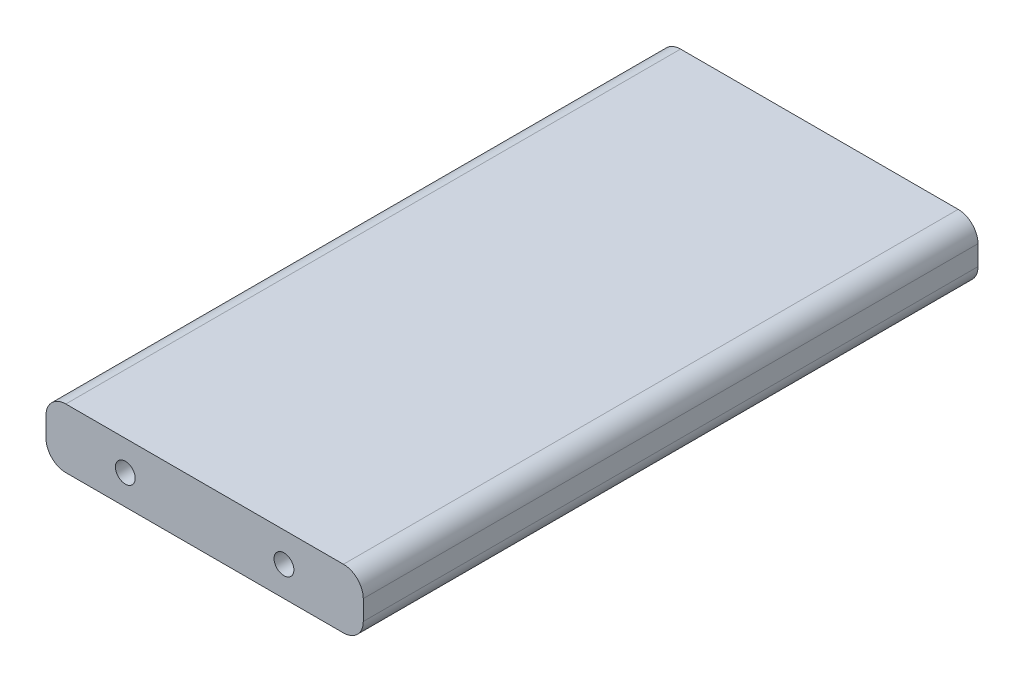
ISO-10303-21;
HEADER;
FILE_DESCRIPTION(('STEP AP214'),'2;1');
FILE_NAME('part.step','',(''),(''),'','','');
FILE_SCHEMA(('AUTOMOTIVE_DESIGN { 1 0 10303 214 1 1 1 1 }'));
ENDSEC;
DATA;
#1=APPLICATION_CONTEXT('core data for automotive mechanical design processes');
#2=APPLICATION_PROTOCOL_DEFINITION('international standard','automotive_design',2000,#1);
#3=PRODUCT_CONTEXT('',#1,'mechanical');
#4=PRODUCT('Part','Part','',(#3));
#5=PRODUCT_RELATED_PRODUCT_CATEGORY('part','',(#4));
#6=PRODUCT_DEFINITION_FORMATION('','',#4);
#7=PRODUCT_DEFINITION_CONTEXT('part definition',#1,'design');
#8=PRODUCT_DEFINITION('design','',#6,#7);
#9=PRODUCT_DEFINITION_SHAPE('','',#8);
#10=(LENGTH_UNIT() NAMED_UNIT(*) SI_UNIT(.MILLI.,.METRE.));
#11=(NAMED_UNIT(*) PLANE_ANGLE_UNIT() SI_UNIT($,.RADIAN.));
#12=(NAMED_UNIT(*) SI_UNIT($,.STERADIAN.) SOLID_ANGLE_UNIT());
#13=UNCERTAINTY_MEASURE_WITH_UNIT(LENGTH_MEASURE(1.E-05),#10,'distance_accuracy_value','');
#14=(GEOMETRIC_REPRESENTATION_CONTEXT(3) GLOBAL_UNCERTAINTY_ASSIGNED_CONTEXT((#13)) GLOBAL_UNIT_ASSIGNED_CONTEXT((#10,
#11,#12)) REPRESENTATION_CONTEXT('',''));
#15=CARTESIAN_POINT('',(0.,0.,0.));
#16=DIRECTION('',(0.,0.,1.));
#17=DIRECTION('',(1.,0.,0.));
#18=AXIS2_PLACEMENT_3D('',#15,#16,#17);
#19=CARTESIAN_POINT('',(-44.45,9.525,98.425));
#20=DIRECTION('',(0.,-1.,0.));
#21=DIRECTION('',(0.,0.,-1.));
#22=AXIS2_PLACEMENT_3D('',#19,#20,#21);
#23=PLANE('',#22);
#24=DIRECTION('',(-1.,0.,0.));
#25=VECTOR('',#24,1.);
#26=CARTESIAN_POINT('',(44.45,9.525,98.425));
#27=LINE('',#26,#25);
#28=CARTESIAN_POINT('',(44.45,9.525,98.425));
#29=VERTEX_POINT('',#28);
#30=CARTESIAN_POINT('',(-44.45,9.525,98.425));
#31=VERTEX_POINT('',#30);
#32=EDGE_CURVE('E98',#29,#31,#27,.T.);
#33=ORIENTED_EDGE('',*,*,#32,.F.);
#34=DIRECTION('',(0.,0.,-1.));
#35=VECTOR('',#34,1.);
#36=CARTESIAN_POINT('',(44.45,9.525,98.425));
#37=LINE('',#36,#35);
#38=CARTESIAN_POINT('',(44.45,9.525,-98.425));
#39=VERTEX_POINT('',#38);
#40=EDGE_CURVE('E11',#29,#39,#37,.T.);
#41=ORIENTED_EDGE('',*,*,#40,.T.);
#42=DIRECTION('',(-1.,0.,0.));
#43=VECTOR('',#42,1.);
#44=CARTESIAN_POINT('',(-44.45,9.525,-98.425));
#45=LINE('',#44,#43);
#46=CARTESIAN_POINT('',(-44.45,9.525,-98.425));
#47=VERTEX_POINT('',#46);
#48=EDGE_CURVE('E111',#39,#47,#45,.T.);
#49=ORIENTED_EDGE('',*,*,#48,.T.);
#50=DIRECTION('',(0.,0.,-1.));
#51=VECTOR('',#50,1.);
#52=CARTESIAN_POINT('',(-44.45,9.525,98.425));
#53=LINE('',#52,#51);
#54=EDGE_CURVE('E109',#31,#47,#53,.T.);
#55=ORIENTED_EDGE('',*,*,#54,.F.);
#56=EDGE_LOOP('',(#33,#41,#49,#55));
#57=FACE_BOUND('',#56,.T.);
#58=ADVANCED_FACE('F33',(#57),#23,.F.);
#59=CARTESIAN_POINT('',(-44.45,3.175,98.425));
#60=DIRECTION('',(0.,0.,-1.));
#61=DIRECTION('',(-1.,0.,0.));
#62=AXIS2_PLACEMENT_3D('',#59,#60,#61);
#63=CYLINDRICAL_SURFACE('',#62,6.35);
#64=CARTESIAN_POINT('',(-44.45,3.175,-98.425));
#65=DIRECTION('',(0.,0.,1.));
#66=DIRECTION('',(1.,0.,0.));
#67=AXIS2_PLACEMENT_3D('',#64,#65,#66);
#68=CIRCLE('',#67,6.35);
#69=CARTESIAN_POINT('',(-50.8,3.17499999999996,-98.425));
#70=VERTEX_POINT('',#69);
#71=EDGE_CURVE('E131',#47,#70,#68,.T.);
#72=ORIENTED_EDGE('',*,*,#71,.T.);
#73=DIRECTION('',(0.,0.,-1.));
#74=VECTOR('',#73,1.);
#75=CARTESIAN_POINT('',(-50.8,3.17499999999996,98.425));
#76=LINE('',#75,#74);
#77=CARTESIAN_POINT('',(-50.8,3.17499999999996,98.425));
#78=VERTEX_POINT('',#77);
#79=EDGE_CURVE('E115',#78,#70,#76,.T.);
#80=ORIENTED_EDGE('',*,*,#79,.F.);
#81=CARTESIAN_POINT('',(-44.45,3.175,98.425));
#82=DIRECTION('',(0.,0.,1.));
#83=DIRECTION('',(1.,0.,0.));
#84=AXIS2_PLACEMENT_3D('',#81,#82,#83);
#85=CIRCLE('',#84,6.35);
#86=EDGE_CURVE('E102',#31,#78,#85,.T.);
#87=ORIENTED_EDGE('',*,*,#86,.F.);
#88=ORIENTED_EDGE('',*,*,#54,.T.);
#89=EDGE_LOOP('',(#72,#80,#87,#88));
#90=FACE_BOUND('',#89,.T.);
#91=ADVANCED_FACE('F117',(#90),#63,.T.);
#92=CARTESIAN_POINT('',(-50.8,-3.17499999999996,98.425));
#93=DIRECTION('',(1.,0.,0.));
#94=DIRECTION('',(0.,0.,-1.));
#95=AXIS2_PLACEMENT_3D('',#92,#93,#94);
#96=PLANE('',#95);
#97=DIRECTION('',(0.,-1.,0.));
#98=VECTOR('',#97,1.);
#99=CARTESIAN_POINT('',(-50.8,-3.17499999999996,-98.425));
#100=LINE('',#99,#98);
#101=CARTESIAN_POINT('',(-50.8,-3.17499999999996,-98.425));
#102=VERTEX_POINT('',#101);
#103=EDGE_CURVE('E134',#70,#102,#100,.T.);
#104=ORIENTED_EDGE('',*,*,#103,.T.);
#105=DIRECTION('',(0.,0.,-1.));
#106=VECTOR('',#105,1.);
#107=CARTESIAN_POINT('',(-50.8,-3.17499999999996,98.425));
#108=LINE('',#107,#106);
#109=CARTESIAN_POINT('',(-50.8,-3.17499999999996,98.425));
#110=VERTEX_POINT('',#109);
#111=EDGE_CURVE('E146',#110,#102,#108,.T.);
#112=ORIENTED_EDGE('',*,*,#111,.F.);
#113=DIRECTION('',(0.,-1.,0.));
#114=VECTOR('',#113,1.);
#115=CARTESIAN_POINT('',(-50.8,-3.17499999999996,98.425));
#116=LINE('',#115,#114);
#117=EDGE_CURVE('E120',#78,#110,#116,.T.);
#118=ORIENTED_EDGE('',*,*,#117,.F.);
#119=ORIENTED_EDGE('',*,*,#79,.T.);
#120=EDGE_LOOP('',(#104,#112,#118,#119));
#121=FACE_BOUND('',#120,.T.);
#122=ADVANCED_FACE('F179',(#121),#96,.F.);
#123=CARTESIAN_POINT('',(-44.45,-3.175,98.425));
#124=DIRECTION('',(0.,0.,-1.));
#125=DIRECTION('',(-1.,0.,0.));
#126=AXIS2_PLACEMENT_3D('',#123,#124,#125);
#127=CYLINDRICAL_SURFACE('',#126,6.35);
#128=CARTESIAN_POINT('',(-44.45,-3.175,-98.425));
#129=DIRECTION('',(0.,0.,1.));
#130=DIRECTION('',(1.,0.,0.));
#131=AXIS2_PLACEMENT_3D('',#128,#129,#130);
#132=CIRCLE('',#131,6.35);
#133=CARTESIAN_POINT('',(-44.45,-9.525,-98.425));
#134=VERTEX_POINT('',#133);
#135=EDGE_CURVE('E136',#102,#134,#132,.T.);
#136=ORIENTED_EDGE('',*,*,#135,.T.);
#137=DIRECTION('',(0.,0.,-1.));
#138=VECTOR('',#137,1.);
#139=CARTESIAN_POINT('',(-44.45,-9.525,98.425));
#140=LINE('',#139,#138);
#141=CARTESIAN_POINT('',(-44.45,-9.525,98.425));
#142=VERTEX_POINT('',#141);
#143=EDGE_CURVE('E129',#142,#134,#140,.T.);
#144=ORIENTED_EDGE('',*,*,#143,.F.);
#145=CARTESIAN_POINT('',(-44.45,-3.175,98.425));
#146=DIRECTION('',(0.,0.,1.));
#147=DIRECTION('',(1.,0.,0.));
#148=AXIS2_PLACEMENT_3D('',#145,#146,#147);
#149=CIRCLE('',#148,6.35);
#150=EDGE_CURVE('E122',#110,#142,#149,.T.);
#151=ORIENTED_EDGE('',*,*,#150,.F.);
#152=ORIENTED_EDGE('',*,*,#111,.T.);
#153=EDGE_LOOP('',(#136,#144,#151,#152));
#154=FACE_BOUND('',#153,.T.);
#155=ADVANCED_FACE('F175',(#154),#127,.T.);
#156=CARTESIAN_POINT('',(44.45,-9.525,98.425));
#157=DIRECTION('',(0.,1.,0.));
#158=DIRECTION('',(0.,0.,1.));
#159=AXIS2_PLACEMENT_3D('',#156,#157,#158);
#160=PLANE('',#159);
#161=DIRECTION('',(1.,0.,0.));
#162=VECTOR('',#161,1.);
#163=CARTESIAN_POINT('',(44.45,-9.525,-98.425));
#164=LINE('',#163,#162);
#165=CARTESIAN_POINT('',(44.45,-9.525,-98.425));
#166=VERTEX_POINT('',#165);
#167=EDGE_CURVE('E139',#134,#166,#164,.T.);
#168=ORIENTED_EDGE('',*,*,#167,.T.);
#169=DIRECTION('',(0.,0.,-1.));
#170=VECTOR('',#169,1.);
#171=CARTESIAN_POINT('',(44.45,-9.525,98.425));
#172=LINE('',#171,#170);
#173=CARTESIAN_POINT('',(44.45,-9.525,98.425));
#174=VERTEX_POINT('',#173);
#175=EDGE_CURVE('E56',#166,#174,#172,.F.);
#176=ORIENTED_EDGE('',*,*,#175,.T.);
#177=DIRECTION('',(1.,0.,0.));
#178=VECTOR('',#177,1.);
#179=CARTESIAN_POINT('',(-44.45,-9.525,98.425));
#180=LINE('',#179,#178);
#181=EDGE_CURVE('E127',#142,#174,#180,.T.);
#182=ORIENTED_EDGE('',*,*,#181,.F.);
#183=ORIENTED_EDGE('',*,*,#143,.T.);
#184=EDGE_LOOP('',(#168,#176,#182,#183));
#185=FACE_BOUND('',#184,.T.);
#186=ADVANCED_FACE('F171',(#185),#160,.F.);
#187=CARTESIAN_POINT('',(50.8,-3.17499999999996,98.425));
#188=DIRECTION('',(-1.,0.,0.));
#189=DIRECTION('',(0.,0.,1.));
#190=AXIS2_PLACEMENT_3D('',#187,#188,#189);
#191=PLANE('',#190);
#192=DIRECTION('',(0.,1.,0.));
#193=VECTOR('',#192,1.);
#194=CARTESIAN_POINT('',(50.8,9.525,98.425));
#195=LINE('',#194,#193);
#196=CARTESIAN_POINT('',(50.8,-3.175,98.425));
#197=VERTEX_POINT('',#196);
#198=CARTESIAN_POINT('',(50.8,3.175,98.425));
#199=VERTEX_POINT('',#198);
#200=EDGE_CURVE('E106',#197,#199,#195,.T.);
#201=ORIENTED_EDGE('',*,*,#200,.F.);
#202=DIRECTION('',(0.,0.,-1.));
#203=VECTOR('',#202,1.);
#204=CARTESIAN_POINT('',(50.8,-3.175,98.425));
#205=LINE('',#204,#203);
#206=CARTESIAN_POINT('',(50.8,-3.175,-98.425));
#207=VERTEX_POINT('',#206);
#208=EDGE_CURVE('E151',#197,#207,#205,.T.);
#209=ORIENTED_EDGE('',*,*,#208,.T.);
#210=DIRECTION('',(0.,1.,0.));
#211=VECTOR('',#210,1.);
#212=CARTESIAN_POINT('',(50.8,-3.17499999999996,-98.425));
#213=LINE('',#212,#211);
#214=CARTESIAN_POINT('',(50.8,3.175,-98.425));
#215=VERTEX_POINT('',#214);
#216=EDGE_CURVE('E141',#207,#215,#213,.T.);
#217=ORIENTED_EDGE('',*,*,#216,.T.);
#218=DIRECTION('',(0.,0.,-1.));
#219=VECTOR('',#218,1.);
#220=CARTESIAN_POINT('',(50.8,3.175,98.425));
#221=LINE('',#220,#219);
#222=EDGE_CURVE('E114',#215,#199,#221,.F.);
#223=ORIENTED_EDGE('',*,*,#222,.T.);
#224=EDGE_LOOP('',(#201,#209,#217,#223));
#225=FACE_BOUND('',#224,.T.);
#226=ADVANCED_FACE('F164',(#225),#191,.F.);
#227=CARTESIAN_POINT('',(-44.45,-3.175,98.425));
#228=DIRECTION('',(0.,0.,1.));
#229=DIRECTION('',(1.,0.,0.));
#230=AXIS2_PLACEMENT_3D('',#227,#228,#229);
#231=PLANE('',#230);
#232=CARTESIAN_POINT('',(-25.4,0.,98.425));
#233=DIRECTION('',(0.,0.,1.));
#234=DIRECTION('',(1.,0.,0.));
#235=AXIS2_PLACEMENT_3D('',#232,#233,#234);
#236=CIRCLE('',#235,3.175);
#237=CARTESIAN_POINT('',(-22.225,0.,98.425));
#238=VERTEX_POINT('',#237);
#239=EDGE_CURVE('E312',#238,#238,#236,.T.);
#240=ORIENTED_EDGE('',*,*,#239,.F.);
#241=EDGE_LOOP('',(#240));
#242=FACE_BOUND('',#241,.T.);
#243=CARTESIAN_POINT('',(25.4,0.,98.425));
#244=DIRECTION('',(0.,0.,1.));
#245=DIRECTION('',(1.,0.,0.));
#246=AXIS2_PLACEMENT_3D('',#243,#244,#245);
#247=CIRCLE('',#246,3.175);
#248=CARTESIAN_POINT('',(28.575,0.,98.425));
#249=VERTEX_POINT('',#248);
#250=EDGE_CURVE('E296',#249,#249,#247,.T.);
#251=ORIENTED_EDGE('',*,*,#250,.F.);
#252=EDGE_LOOP('',(#251));
#253=FACE_BOUND('',#252,.T.);
#254=ORIENTED_EDGE('',*,*,#181,.T.);
#255=CARTESIAN_POINT('',(44.45,-3.175,98.425));
#256=DIRECTION('',(0.,0.,1.));
#257=DIRECTION('',(1.,0.,0.));
#258=AXIS2_PLACEMENT_3D('',#255,#256,#257);
#259=CIRCLE('',#258,6.35);
#260=EDGE_CURVE('E41',#174,#197,#259,.T.);
#261=ORIENTED_EDGE('',*,*,#260,.T.);
#262=ORIENTED_EDGE('',*,*,#200,.T.);
#263=CARTESIAN_POINT('',(44.45,3.175,98.425));
#264=DIRECTION('',(0.,0.,1.));
#265=DIRECTION('',(1.,0.,0.));
#266=AXIS2_PLACEMENT_3D('',#263,#264,#265);
#267=CIRCLE('',#266,6.35);
#268=EDGE_CURVE('E48',#199,#29,#267,.T.);
#269=ORIENTED_EDGE('',*,*,#268,.T.);
#270=ORIENTED_EDGE('',*,*,#32,.T.);
#271=ORIENTED_EDGE('',*,*,#86,.T.);
#272=ORIENTED_EDGE('',*,*,#117,.T.);
#273=ORIENTED_EDGE('',*,*,#150,.T.);
#274=EDGE_LOOP('',(#254,#261,#262,#269,#270,#271,#272,#273));
#275=FACE_BOUND('',#274,.T.);
#276=ADVANCED_FACE('F100',(#242,#253,#275),#231,.T.);
#277=CARTESIAN_POINT('',(-44.45,-3.175,-98.425));
#278=DIRECTION('',(0.,0.,1.));
#279=DIRECTION('',(1.,0.,0.));
#280=AXIS2_PLACEMENT_3D('',#277,#278,#279);
#281=PLANE('',#280);
#282=CARTESIAN_POINT('',(-25.4,0.,-98.425));
#283=DIRECTION('',(0.,0.,1.));
#284=DIRECTION('',(1.,0.,0.));
#285=AXIS2_PLACEMENT_3D('',#282,#283,#284);
#286=CIRCLE('',#285,3.175);
#287=CARTESIAN_POINT('',(-22.225,0.,-98.425));
#288=VERTEX_POINT('',#287);
#289=EDGE_CURVE('E297',#288,#288,#286,.T.);
#290=ORIENTED_EDGE('',*,*,#289,.T.);
#291=EDGE_LOOP('',(#290));
#292=FACE_BOUND('',#291,.T.);
#293=CARTESIAN_POINT('',(25.4,0.,-98.425));
#294=DIRECTION('',(0.,0.,1.));
#295=DIRECTION('',(1.,0.,0.));
#296=AXIS2_PLACEMENT_3D('',#293,#294,#295);
#297=CIRCLE('',#296,3.175);
#298=CARTESIAN_POINT('',(28.575,0.,-98.425));
#299=VERTEX_POINT('',#298);
#300=EDGE_CURVE('E308',#299,#299,#297,.T.);
#301=ORIENTED_EDGE('',*,*,#300,.T.);
#302=EDGE_LOOP('',(#301));
#303=FACE_BOUND('',#302,.T.);
#304=ORIENTED_EDGE('',*,*,#216,.F.);
#305=CARTESIAN_POINT('',(44.45,-3.175,-98.425));
#306=DIRECTION('',(0.,0.,1.));
#307=DIRECTION('',(1.,0.,0.));
#308=AXIS2_PLACEMENT_3D('',#305,#306,#307);
#309=CIRCLE('',#308,6.35);
#310=EDGE_CURVE('E156',#207,#166,#309,.F.);
#311=ORIENTED_EDGE('',*,*,#310,.T.);
#312=ORIENTED_EDGE('',*,*,#167,.F.);
#313=ORIENTED_EDGE('',*,*,#135,.F.);
#314=ORIENTED_EDGE('',*,*,#103,.F.);
#315=ORIENTED_EDGE('',*,*,#71,.F.);
#316=ORIENTED_EDGE('',*,*,#48,.F.);
#317=CARTESIAN_POINT('',(44.45,3.175,-98.425));
#318=DIRECTION('',(0.,0.,1.));
#319=DIRECTION('',(1.,0.,0.));
#320=AXIS2_PLACEMENT_3D('',#317,#318,#319);
#321=CIRCLE('',#320,6.35);
#322=EDGE_CURVE('E154',#39,#215,#321,.F.);
#323=ORIENTED_EDGE('',*,*,#322,.T.);
#324=EDGE_LOOP('',(#304,#311,#312,#313,#314,#315,#316,#323));
#325=FACE_BOUND('',#324,.T.);
#326=ADVANCED_FACE('F169',(#292,#303,#325),#281,.F.);
#327=CARTESIAN_POINT('',(25.4,0.,85.725));
#328=DIRECTION('',(0.,0.,1.));
#329=DIRECTION('',(1.,0.,0.));
#330=AXIS2_PLACEMENT_3D('',#327,#328,#329);
#331=CYLINDRICAL_SURFACE('',#330,3.175);
#332=CARTESIAN_POINT('',(25.4,0.,85.725));
#333=DIRECTION('',(0.,0.,1.));
#334=DIRECTION('',(1.,0.,0.));
#335=AXIS2_PLACEMENT_3D('',#332,#333,#334);
#336=CIRCLE('',#335,3.175);
#337=CARTESIAN_POINT('',(28.575,0.,85.725));
#338=VERTEX_POINT('',#337);
#339=EDGE_CURVE('E300',#338,#338,#336,.T.);
#340=ORIENTED_EDGE('',*,*,#339,.F.);
#341=EDGE_LOOP('',(#340));
#342=FACE_BOUND('',#341,.T.);
#343=ORIENTED_EDGE('',*,*,#250,.T.);
#344=EDGE_LOOP('',(#343));
#345=FACE_BOUND('',#344,.T.);
#346=ADVANCED_FACE('F216',(#342,#345),#331,.F.);
#347=CARTESIAN_POINT('',(25.4,0.,85.725));
#348=DIRECTION('',(0.,0.,1.));
#349=DIRECTION('',(1.,0.,0.));
#350=AXIS2_PLACEMENT_3D('',#347,#348,#349);
#351=PLANE('',#350);
#352=ORIENTED_EDGE('',*,*,#339,.T.);
#353=EDGE_LOOP('',(#352));
#354=FACE_BOUND('',#353,.T.);
#355=ADVANCED_FACE('F207',(#354),#351,.T.);
#356=CARTESIAN_POINT('',(-25.4,0.,85.725));
#357=DIRECTION('',(0.,0.,1.));
#358=DIRECTION('',(1.,0.,0.));
#359=AXIS2_PLACEMENT_3D('',#356,#357,#358);
#360=CYLINDRICAL_SURFACE('',#359,3.175);
#361=CARTESIAN_POINT('',(-25.4,0.,85.725));
#362=DIRECTION('',(0.,0.,1.));
#363=DIRECTION('',(1.,0.,0.));
#364=AXIS2_PLACEMENT_3D('',#361,#362,#363);
#365=CIRCLE('',#364,3.175);
#366=CARTESIAN_POINT('',(-22.225,0.,85.725));
#367=VERTEX_POINT('',#366);
#368=EDGE_CURVE('E132',#367,#367,#365,.T.);
#369=ORIENTED_EDGE('',*,*,#368,.F.);
#370=EDGE_LOOP('',(#369));
#371=FACE_BOUND('',#370,.T.);
#372=ORIENTED_EDGE('',*,*,#239,.T.);
#373=EDGE_LOOP('',(#372));
#374=FACE_BOUND('',#373,.T.);
#375=ADVANCED_FACE('F202',(#371,#374),#360,.F.);
#376=CARTESIAN_POINT('',(-25.4,0.,85.725));
#377=DIRECTION('',(0.,0.,1.));
#378=DIRECTION('',(1.,0.,0.));
#379=AXIS2_PLACEMENT_3D('',#376,#377,#378);
#380=PLANE('',#379);
#381=ORIENTED_EDGE('',*,*,#368,.T.);
#382=EDGE_LOOP('',(#381));
#383=FACE_BOUND('',#382,.T.);
#384=ADVANCED_FACE('F195',(#383),#380,.T.);
#385=CARTESIAN_POINT('',(44.45,-3.175,98.425));
#386=DIRECTION('',(0.,0.,-1.));
#387=DIRECTION('',(-1.,0.,0.));
#388=AXIS2_PLACEMENT_3D('',#385,#386,#387);
#389=CYLINDRICAL_SURFACE('',#388,6.35);
#390=ORIENTED_EDGE('',*,*,#260,.F.);
#391=ORIENTED_EDGE('',*,*,#175,.F.);
#392=ORIENTED_EDGE('',*,*,#310,.F.);
#393=ORIENTED_EDGE('',*,*,#208,.F.);
#394=EDGE_LOOP('',(#390,#391,#392,#393));
#395=FACE_BOUND('',#394,.T.);
#396=ADVANCED_FACE('F167',(#395),#389,.T.);
#397=CARTESIAN_POINT('',(44.45,3.175,98.425));
#398=DIRECTION('',(0.,0.,-1.));
#399=DIRECTION('',(-1.,0.,0.));
#400=AXIS2_PLACEMENT_3D('',#397,#398,#399);
#401=CYLINDRICAL_SURFACE('',#400,6.35);
#402=ORIENTED_EDGE('',*,*,#268,.F.);
#403=ORIENTED_EDGE('',*,*,#222,.F.);
#404=ORIENTED_EDGE('',*,*,#322,.F.);
#405=ORIENTED_EDGE('',*,*,#40,.F.);
#406=EDGE_LOOP('',(#402,#403,#404,#405));
#407=FACE_BOUND('',#406,.T.);
#408=ADVANCED_FACE('F35',(#407),#401,.T.);
#409=CARTESIAN_POINT('',(25.4,0.,-85.725));
#410=DIRECTION('',(0.,0.,-1.));
#411=DIRECTION('',(-1.,0.,0.));
#412=AXIS2_PLACEMENT_3D('',#409,#410,#411);
#413=CYLINDRICAL_SURFACE('',#412,3.175);
#414=CARTESIAN_POINT('',(25.4,0.,-85.725));
#415=DIRECTION('',(0.,0.,1.));
#416=DIRECTION('',(1.,0.,0.));
#417=AXIS2_PLACEMENT_3D('',#414,#415,#416);
#418=CIRCLE('',#417,3.175);
#419=CARTESIAN_POINT('',(28.575,0.,-85.725));
#420=VERTEX_POINT('',#419);
#421=EDGE_CURVE('E303',#420,#420,#418,.T.);
#422=ORIENTED_EDGE('',*,*,#421,.T.);
#423=EDGE_LOOP('',(#422));
#424=FACE_BOUND('',#423,.T.);
#425=ORIENTED_EDGE('',*,*,#300,.F.);
#426=EDGE_LOOP('',(#425));
#427=FACE_BOUND('',#426,.T.);
#428=ADVANCED_FACE('F200',(#424,#427),#413,.F.);
#429=CARTESIAN_POINT('',(25.4,0.,-85.725));
#430=DIRECTION('',(0.,0.,-1.));
#431=DIRECTION('',(1.,0.,0.));
#432=AXIS2_PLACEMENT_3D('',#429,#430,#431);
#433=PLANE('',#432);
#434=ORIENTED_EDGE('',*,*,#421,.F.);
#435=EDGE_LOOP('',(#434));
#436=FACE_BOUND('',#435,.T.);
#437=ADVANCED_FACE('F261',(#436),#433,.T.);
#438=CARTESIAN_POINT('',(-25.4,0.,-85.725));
#439=DIRECTION('',(0.,0.,-1.));
#440=DIRECTION('',(-1.,0.,0.));
#441=AXIS2_PLACEMENT_3D('',#438,#439,#440);
#442=CYLINDRICAL_SURFACE('',#441,3.175);
#443=CARTESIAN_POINT('',(-25.4,0.,-85.725));
#444=DIRECTION('',(0.,0.,1.));
#445=DIRECTION('',(1.,0.,0.));
#446=AXIS2_PLACEMENT_3D('',#443,#444,#445);
#447=CIRCLE('',#446,3.175);
#448=CARTESIAN_POINT('',(-22.225,0.,-85.725));
#449=VERTEX_POINT('',#448);
#450=EDGE_CURVE('E295',#449,#449,#447,.T.);
#451=ORIENTED_EDGE('',*,*,#450,.T.);
#452=EDGE_LOOP('',(#451));
#453=FACE_BOUND('',#452,.T.);
#454=ORIENTED_EDGE('',*,*,#289,.F.);
#455=EDGE_LOOP('',(#454));
#456=FACE_BOUND('',#455,.T.);
#457=ADVANCED_FACE('F270',(#453,#456),#442,.F.);
#458=CARTESIAN_POINT('',(-25.4,0.,-85.725));
#459=DIRECTION('',(0.,0.,-1.));
#460=DIRECTION('',(1.,0.,0.));
#461=AXIS2_PLACEMENT_3D('',#458,#459,#460);
#462=PLANE('',#461);
#463=ORIENTED_EDGE('',*,*,#450,.F.);
#464=EDGE_LOOP('',(#463));
#465=FACE_BOUND('',#464,.T.);
#466=ADVANCED_FACE('F279',(#465),#462,.T.);
#467=CLOSED_SHELL('',(#58,#91,#122,#155,#186,#226,#276,#326,#346,#355,#375,#384,#396,#408,#428,
#437,#457,#466));
#468=MANIFOLD_SOLID_BREP('B2',#467);
#469=ADVANCED_BREP_SHAPE_REPRESENTATION('',(#18,#468),#14);
#470=SHAPE_DEFINITION_REPRESENTATION(#9,#469);
ENDSEC;
END-ISO-10303-21;
